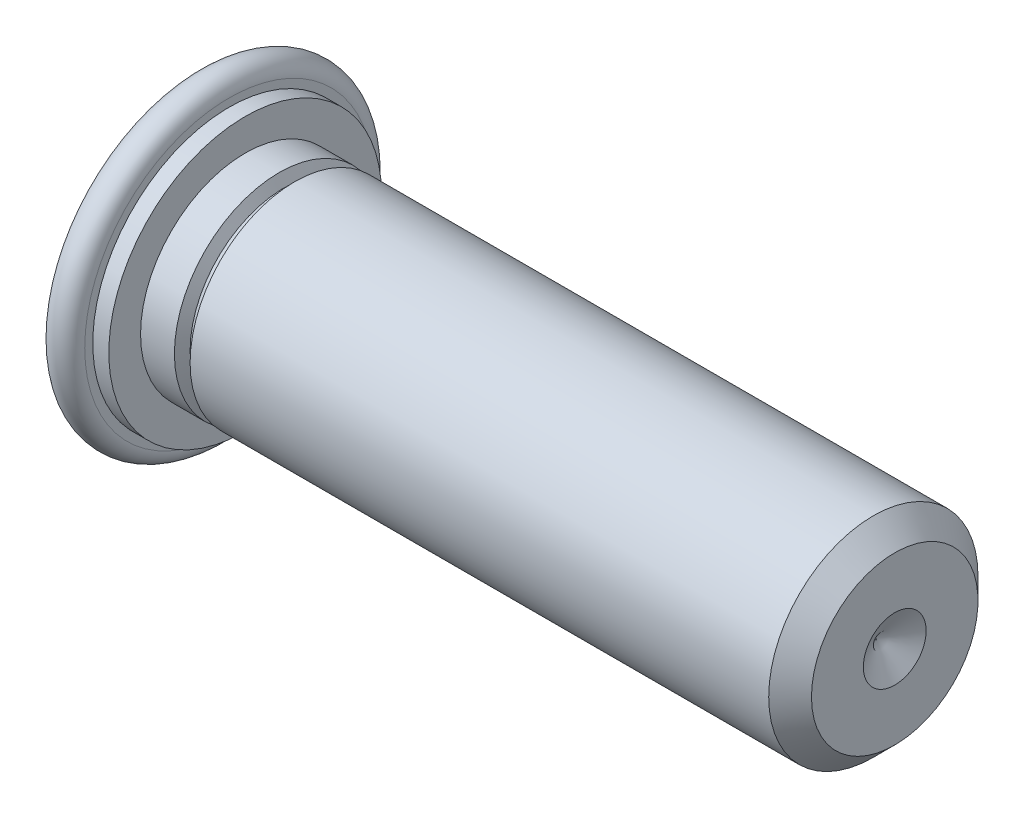
ISO-10303-21;
HEADER;
FILE_DESCRIPTION(('STEP AP214'),'2;1');
FILE_NAME('part.step','',(''),(''),'','','');
FILE_SCHEMA(('AUTOMOTIVE_DESIGN { 1 0 10303 214 1 1 1 1 }'));
ENDSEC;
DATA;
#1=APPLICATION_CONTEXT('core data for automotive mechanical design processes');
#2=APPLICATION_PROTOCOL_DEFINITION('international standard','automotive_design',2000,#1);
#3=PRODUCT_CONTEXT('',#1,'mechanical');
#4=PRODUCT('Part','Part','',(#3));
#5=PRODUCT_RELATED_PRODUCT_CATEGORY('part','',(#4));
#6=PRODUCT_DEFINITION_FORMATION('','',#4);
#7=PRODUCT_DEFINITION_CONTEXT('part definition',#1,'design');
#8=PRODUCT_DEFINITION('design','',#6,#7);
#9=PRODUCT_DEFINITION_SHAPE('','',#8);
#10=(LENGTH_UNIT() NAMED_UNIT(*) SI_UNIT(.MILLI.,.METRE.));
#11=(NAMED_UNIT(*) PLANE_ANGLE_UNIT() SI_UNIT($,.RADIAN.));
#12=(NAMED_UNIT(*) SI_UNIT($,.STERADIAN.) SOLID_ANGLE_UNIT());
#13=UNCERTAINTY_MEASURE_WITH_UNIT(LENGTH_MEASURE(1.E-05),#10,'distance_accuracy_value','');
#14=(GEOMETRIC_REPRESENTATION_CONTEXT(3) GLOBAL_UNCERTAINTY_ASSIGNED_CONTEXT((#13)) GLOBAL_UNIT_ASSIGNED_CONTEXT((#10,
#11,#12)) REPRESENTATION_CONTEXT('',''));
#15=CARTESIAN_POINT('',(0.,0.,0.));
#16=DIRECTION('',(0.,0.,1.));
#17=DIRECTION('',(1.,0.,0.));
#18=AXIS2_PLACEMENT_3D('',#15,#16,#17);
#19=CARTESIAN_POINT('',(0.,0.,1.035));
#20=DIRECTION('',(-1.,0.,0.));
#21=DIRECTION('',(0.,0.,1.));
#22=AXIS2_PLACEMENT_3D('',#19,#20,#21);
#23=PLANE('',#22);
#24=CARTESIAN_POINT('',(1.00000005021431E-10,0.,0.));
#25=DIRECTION('',(1.,0.,0.));
#26=DIRECTION('',(0.,0.,-1.));
#27=AXIS2_PLACEMENT_3D('',#24,#25,#26);
#28=CIRCLE('',#27,2.07);
#29=CARTESIAN_POINT('',(4.50001711731381E-11,0.,-2.07000067823307));
#30=VERTEX_POINT('',#29);
#31=CARTESIAN_POINT('',(4.49999141682172E-11,0.,2.07000067823307));
#32=VERTEX_POINT('',#31);
#33=EDGE_CURVE('E43',#30,#32,#28,.T.);
#34=ORIENTED_EDGE('',*,*,#33,.F.);
#35=CARTESIAN_POINT('',(1.00000005021431E-10,0.,0.));
#36=DIRECTION('',(1.,0.,0.));
#37=DIRECTION('',(0.,0.,1.));
#38=AXIS2_PLACEMENT_3D('',#35,#36,#37);
#39=CIRCLE('',#38,2.07);
#40=EDGE_CURVE('E47',#32,#30,#39,.T.);
#41=ORIENTED_EDGE('',*,*,#40,.F.);
#42=EDGE_LOOP('',(#34,#41));
#43=FACE_BOUND('',#42,.T.);
#44=ADVANCED_FACE('F16',(#43),#23,.T.);
#45=CARTESIAN_POINT('',(0.23,0.,0.));
#46=DIRECTION('',(-1.,0.,0.));
#47=DIRECTION('',(0.,0.,1.));
#48=AXIS2_PLACEMENT_3D('',#45,#46,#47);
#49=TOROIDAL_SURFACE('',#48,2.07000678233067,0.23);
#50=ORIENTED_EDGE('',*,*,#33,.T.);
#51=ORIENTED_EDGE('',*,*,#40,.T.);
#52=EDGE_LOOP('',(#50,#51));
#53=FACE_BOUND('',#52,.T.);
#54=CARTESIAN_POINT('',(0.459999999975,0.,0.));
#55=DIRECTION('',(-1.,0.,0.));
#56=DIRECTION('',(0.,0.,1.));
#57=AXIS2_PLACEMENT_3D('',#54,#55,#56);
#58=CIRCLE('',#57,2.07000339116533);
#59=CARTESIAN_POINT('',(0.459999999965,0.,-2.0700020346992));
#60=VERTEX_POINT('',#59);
#61=CARTESIAN_POINT('',(0.459999999965,0.,2.0700020346992));
#62=VERTEX_POINT('',#61);
#63=EDGE_CURVE('E54',#60,#62,#58,.F.);
#64=ORIENTED_EDGE('',*,*,#63,.F.);
#65=CARTESIAN_POINT('',(0.459999999975,0.,0.));
#66=DIRECTION('',(-1.,0.,0.));
#67=DIRECTION('',(0.,0.,-1.));
#68=AXIS2_PLACEMENT_3D('',#65,#66,#67);
#69=CIRCLE('',#68,2.07000339116533);
#70=EDGE_CURVE('E83',#62,#60,#69,.F.);
#71=ORIENTED_EDGE('',*,*,#70,.F.);
#72=EDGE_LOOP('',(#64,#71));
#73=FACE_BOUND('',#72,.T.);
#74=ADVANCED_FACE('F52',(#53,#73),#49,.T.);
#75=CARTESIAN_POINT('',(0.45999999995,0.,1.785));
#76=DIRECTION('',(1.,0.,0.));
#77=DIRECTION('',(0.,0.,-1.));
#78=AXIS2_PLACEMENT_3D('',#75,#76,#77);
#79=PLANE('',#78);
#80=ORIENTED_EDGE('',*,*,#63,.T.);
#81=ORIENTED_EDGE('',*,*,#70,.T.);
#82=EDGE_LOOP('',(#80,#81));
#83=FACE_BOUND('',#82,.T.);
#84=CARTESIAN_POINT('',(0.459999999950001,0.,0.));
#85=DIRECTION('',(1.,0.,0.));
#86=DIRECTION('',(0.,0.,-1.));
#87=AXIS2_PLACEMENT_3D('',#84,#85,#86);
#88=CIRCLE('',#87,1.955);
#89=CARTESIAN_POINT('',(0.459999999950001,0.,-1.955));
#90=VERTEX_POINT('',#89);
#91=EDGE_CURVE('E93',#90,#90,#88,.T.);
#92=ORIENTED_EDGE('',*,*,#91,.F.);
#93=EDGE_LOOP('',(#92));
#94=FACE_BOUND('',#93,.T.);
#95=ADVANCED_FACE('F71',(#83,#94),#79,.T.);
#96=CARTESIAN_POINT('',(0.575,0.,0.));
#97=DIRECTION('',(1.,0.,0.));
#98=DIRECTION('',(0.,0.,-1.));
#99=AXIS2_PLACEMENT_3D('',#96,#97,#98);
#100=CYLINDRICAL_SURFACE('',#99,1.955);
#101=CARTESIAN_POINT('',(0.69,0.,0.));
#102=DIRECTION('',(1.,0.,0.));
#103=DIRECTION('',(0.,0.,-1.));
#104=AXIS2_PLACEMENT_3D('',#101,#102,#103);
#105=CIRCLE('',#104,1.955);
#106=CARTESIAN_POINT('',(0.690000000000001,0.,-1.955));
#107=VERTEX_POINT('',#106);
#108=EDGE_CURVE('E182',#107,#107,#105,.T.);
#109=ORIENTED_EDGE('',*,*,#108,.F.);
#110=EDGE_LOOP('',(#109));
#111=FACE_BOUND('',#110,.T.);
#112=ORIENTED_EDGE('',*,*,#91,.T.);
#113=EDGE_LOOP('',(#112));
#114=FACE_BOUND('',#113,.T.);
#115=ADVANCED_FACE('F143',(#111,#114),#100,.T.);
#116=CARTESIAN_POINT('',(0.69,0.,0.));
#117=DIRECTION('',(1.,0.,0.));
#118=DIRECTION('',(0.,0.,-1.));
#119=AXIS2_PLACEMENT_3D('',#116,#117,#118);
#120=PLANE('',#119);
#121=ORIENTED_EDGE('',*,*,#108,.T.);
#122=EDGE_LOOP('',(#121));
#123=FACE_BOUND('',#122,.T.);
#124=CARTESIAN_POINT('',(0.69,0.,0.));
#125=DIRECTION('',(-1.,0.,0.));
#126=DIRECTION('',(0.,0.,1.));
#127=AXIS2_PLACEMENT_3D('',#124,#125,#126);
#128=CIRCLE('',#127,1.5);
#129=CARTESIAN_POINT('',(0.69,0.,1.5));
#130=VERTEX_POINT('',#129);
#131=EDGE_CURVE('E109',#130,#130,#128,.F.);
#132=ORIENTED_EDGE('',*,*,#131,.F.);
#133=EDGE_LOOP('',(#132));
#134=FACE_BOUND('',#133,.T.);
#135=ADVANCED_FACE('F140',(#123,#134),#120,.T.);
#136=CARTESIAN_POINT('',(5.07675,0.,0.));
#137=DIRECTION('',(-1.,0.,0.));
#138=DIRECTION('',(0.,0.,1.));
#139=AXIS2_PLACEMENT_3D('',#136,#137,#138);
#140=CYLINDRICAL_SURFACE('',#139,1.5);
#141=ORIENTED_EDGE('',*,*,#131,.T.);
#142=EDGE_LOOP('',(#141));
#143=FACE_BOUND('',#142,.T.);
#144=CARTESIAN_POINT('',(1.17500000007453,0.,0.));
#145=DIRECTION('',(-1.,0.,0.));
#146=DIRECTION('',(0.,0.,-1.));
#147=AXIS2_PLACEMENT_3D('',#144,#145,#146);
#148=CIRCLE('',#147,1.49999999996453);
#149=CARTESIAN_POINT('',(1.17500000007453,0.,-1.49999999996453));
#150=VERTEX_POINT('',#149);
#151=EDGE_CURVE('E98',#150,#150,#148,.F.);
#152=ORIENTED_EDGE('',*,*,#151,.F.);
#153=EDGE_LOOP('',(#152));
#154=FACE_BOUND('',#153,.T.);
#155=ADVANCED_FACE('F136',(#143,#154),#140,.T.);
#156=CARTESIAN_POINT('',(1.17500000018822,0.,0.));
#157=DIRECTION('',(-1.,0.,0.));
#158=DIRECTION('',(0.,0.,1.));
#159=AXIS2_PLACEMENT_3D('',#156,#157,#158);
#160=CONICAL_SURFACE('',#159,1.49999999973716,1.10714871779409);
#161=CARTESIAN_POINT('',(1.25000000005,0.,0.));
#162=DIRECTION('',(-1.,0.,0.));
#163=DIRECTION('',(0.,0.,1.));
#164=AXIS2_PLACEMENT_3D('',#161,#162,#163);
#165=CIRCLE('',#164,1.3500000000866);
#166=CARTESIAN_POINT('',(1.25000000005,0.,1.3500000000866));
#167=VERTEX_POINT('',#166);
#168=EDGE_CURVE('E108',#167,#167,#165,.T.);
#169=ORIENTED_EDGE('',*,*,#168,.T.);
#170=EDGE_LOOP('',(#169));
#171=FACE_BOUND('',#170,.T.);
#172=ORIENTED_EDGE('',*,*,#151,.T.);
#173=EDGE_LOOP('',(#172));
#174=FACE_BOUND('',#173,.T.);
#175=ADVANCED_FACE('F133',(#171,#174),#160,.T.);
#176=CARTESIAN_POINT('',(9.99999999999091,0.,0.));
#177=DIRECTION('',(1.,0.,0.));
#178=DIRECTION('',(0.,0.,-1.));
#179=AXIS2_PLACEMENT_3D('',#176,#177,#178);
#180=CONICAL_SURFACE('',#179,0.450000000057571,1.04719755102606);
#181=CARTESIAN_POINT('',(9.74019237881407,0.,5.6843418860808E-11));
#182=VERTEX_POINT('',#181);
#183=VERTEX_LOOP('',#182);
#184=FACE_BOUND('',#183,.T.);
#185=CARTESIAN_POINT('',(9.99999999999091,0.,0.));
#186=DIRECTION('',(1.,0.,0.));
#187=DIRECTION('',(0.,0.,-1.));
#188=AXIS2_PLACEMENT_3D('',#185,#186,#187);
#189=CIRCLE('',#188,0.450000000057571);
#190=CARTESIAN_POINT('',(9.99999999999091,0.,-0.450000000057571));
#191=VERTEX_POINT('',#190);
#192=EDGE_CURVE('E112',#191,#191,#189,.F.);
#193=ORIENTED_EDGE('',*,*,#192,.F.);
#194=EDGE_LOOP('',(#193));
#195=FACE_BOUND('',#194,.T.);
#196=ADVANCED_FACE('F129',(#184,#195),#180,.F.);
#197=CARTESIAN_POINT('',(10.,0.,0.59675));
#198=DIRECTION('',(1.,0.,0.));
#199=DIRECTION('',(0.,0.,-1.));
#200=AXIS2_PLACEMENT_3D('',#197,#198,#199);
#201=PLANE('',#200);
#202=CARTESIAN_POINT('',(9.99999999993406,0.,0.));
#203=DIRECTION('',(-1.,0.,0.));
#204=DIRECTION('',(0.,0.,1.));
#205=AXIS2_PLACEMENT_3D('',#202,#203,#204);
#206=CIRCLE('',#205,1.19350000005625);
#207=CARTESIAN_POINT('',(9.99999999993406,0.,1.19350000005625));
#208=VERTEX_POINT('',#207);
#209=EDGE_CURVE('E169',#208,#208,#206,.T.);
#210=ORIENTED_EDGE('',*,*,#209,.F.);
#211=EDGE_LOOP('',(#210));
#212=FACE_BOUND('',#211,.T.);
#213=ORIENTED_EDGE('',*,*,#192,.T.);
#214=EDGE_LOOP('',(#213));
#215=FACE_BOUND('',#214,.T.);
#216=ADVANCED_FACE('F124',(#212,#215),#201,.T.);
#217=CARTESIAN_POINT('',(1.2875,0.,0.));
#218=DIRECTION('',(-1.,0.,0.));
#219=DIRECTION('',(0.,0.,1.));
#220=AXIS2_PLACEMENT_3D('',#217,#218,#219);
#221=TOROIDAL_SURFACE('',#220,1.4149519053993,0.075);
#222=ORIENTED_EDGE('',*,*,#168,.F.);
#223=EDGE_LOOP('',(#222));
#224=FACE_BOUND('',#223,.T.);
#225=CARTESIAN_POINT('',(1.32499999998004,0.,0.));
#226=DIRECTION('',(1.,0.,0.));
#227=DIRECTION('',(0.,0.,-1.));
#228=AXIS2_PLACEMENT_3D('',#225,#226,#227);
#229=CIRCLE('',#228,1.34999999994534);
#230=CARTESIAN_POINT('',(1.32499999998004,0.,-1.34999999994534));
#231=VERTEX_POINT('',#230);
#232=EDGE_CURVE('E115',#231,#231,#229,.T.);
#233=ORIENTED_EDGE('',*,*,#232,.F.);
#234=EDGE_LOOP('',(#233));
#235=FACE_BOUND('',#234,.T.);
#236=ADVANCED_FACE('F119',(#224,#235),#221,.F.);
#237=CARTESIAN_POINT('',(9.69349999996894,0.,0.));
#238=DIRECTION('',(-1.,0.,0.));
#239=DIRECTION('',(0.,0.,1.));
#240=AXIS2_PLACEMENT_3D('',#237,#238,#239);
#241=CONICAL_SURFACE('',#240,1.50000000002137,0.785398163397448);
#242=ORIENTED_EDGE('',*,*,#209,.T.);
#243=EDGE_LOOP('',(#242));
#244=FACE_BOUND('',#243,.T.);
#245=CARTESIAN_POINT('',(9.6935,0.,0.));
#246=DIRECTION('',(-1.,0.,0.));
#247=DIRECTION('',(0.,0.,1.));
#248=AXIS2_PLACEMENT_3D('',#245,#246,#247);
#249=CIRCLE('',#248,1.5);
#250=CARTESIAN_POINT('',(9.6935,0.,1.5));
#251=VERTEX_POINT('',#250);
#252=EDGE_CURVE('E27',#251,#251,#249,.T.);
#253=ORIENTED_EDGE('',*,*,#252,.F.);
#254=EDGE_LOOP('',(#253));
#255=FACE_BOUND('',#254,.T.);
#256=ADVANCED_FACE('F123',(#244,#255),#241,.T.);
#257=CARTESIAN_POINT('',(1.40000000001805,0.,0.));
#258=DIRECTION('',(1.,0.,0.));
#259=DIRECTION('',(0.,0.,-1.));
#260=AXIS2_PLACEMENT_3D('',#257,#258,#259);
#261=CONICAL_SURFACE('',#260,1.50000000002137,1.10714871779409);
#262=CARTESIAN_POINT('',(1.4,0.,0.));
#263=DIRECTION('',(-1.,0.,0.));
#264=DIRECTION('',(0.,0.,1.));
#265=AXIS2_PLACEMENT_3D('',#262,#263,#264);
#266=CIRCLE('',#265,1.5);
#267=CARTESIAN_POINT('',(1.4,0.,1.5));
#268=VERTEX_POINT('',#267);
#269=EDGE_CURVE('E10',#268,#268,#266,.F.);
#270=ORIENTED_EDGE('',*,*,#269,.F.);
#271=EDGE_LOOP('',(#270));
#272=FACE_BOUND('',#271,.T.);
#273=ORIENTED_EDGE('',*,*,#232,.T.);
#274=EDGE_LOOP('',(#273));
#275=FACE_BOUND('',#274,.T.);
#276=ADVANCED_FACE('F155',(#272,#275),#261,.T.);
#277=CARTESIAN_POINT('',(5.07675,0.,0.));
#278=DIRECTION('',(-1.,0.,0.));
#279=DIRECTION('',(0.,0.,1.));
#280=AXIS2_PLACEMENT_3D('',#277,#278,#279);
#281=CYLINDRICAL_SURFACE('',#280,1.5);
#282=ORIENTED_EDGE('',*,*,#252,.T.);
#283=EDGE_LOOP('',(#282));
#284=FACE_BOUND('',#283,.T.);
#285=ORIENTED_EDGE('',*,*,#269,.T.);
#286=EDGE_LOOP('',(#285));
#287=FACE_BOUND('',#286,.T.);
#288=ADVANCED_FACE('F153',(#284,#287),#281,.T.);
#289=CLOSED_SHELL('',(#44,#74,#95,#115,#135,#155,#175,#196,#216,#236,#256,#276,#288));
#290=MANIFOLD_SOLID_BREP('B1',#289);
#291=ADVANCED_BREP_SHAPE_REPRESENTATION('',(#18,#290),#14);
#292=SHAPE_DEFINITION_REPRESENTATION(#9,#291);
ENDSEC;
END-ISO-10303-21;
